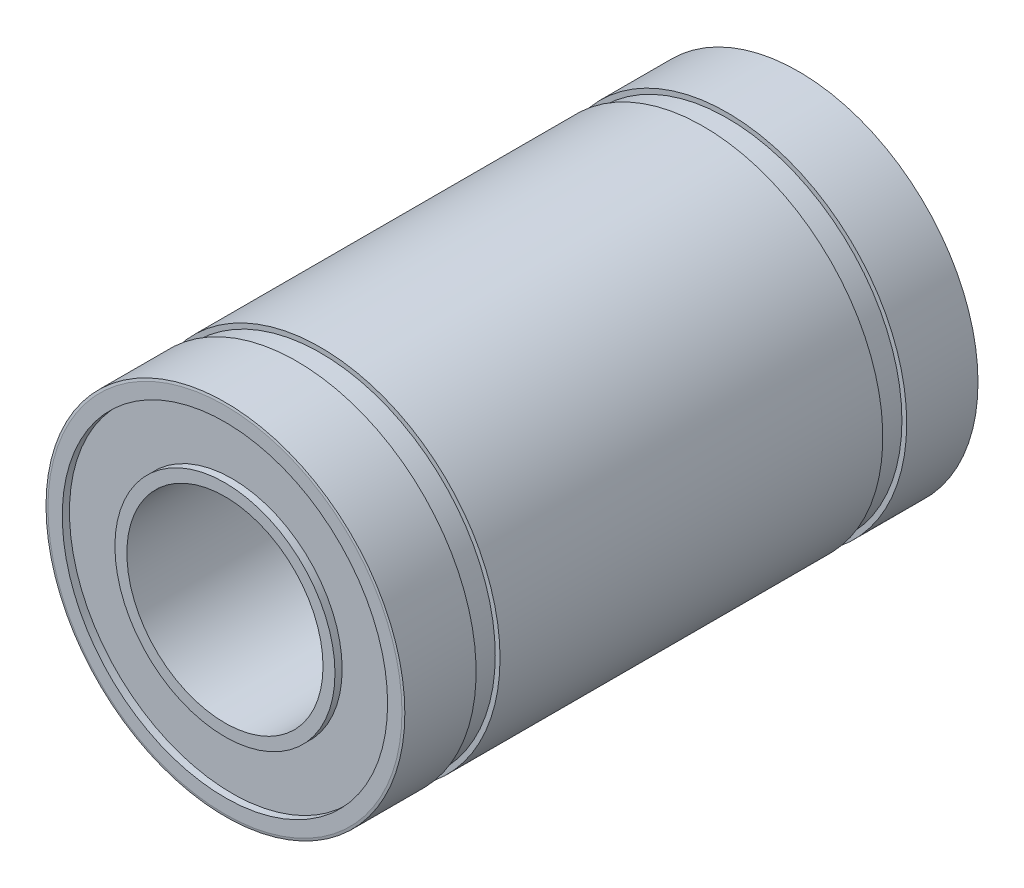
ISO-10303-21;
HEADER;
FILE_DESCRIPTION(('STEP AP214'),'2;1');
FILE_NAME('part.step','',(''),(''),'','','');
FILE_SCHEMA(('AUTOMOTIVE_DESIGN { 1 0 10303 214 1 1 1 1 }'));
ENDSEC;
DATA;
#1=APPLICATION_CONTEXT('core data for automotive mechanical design processes');
#2=APPLICATION_PROTOCOL_DEFINITION('international standard','automotive_design',2000,#1);
#3=PRODUCT_CONTEXT('',#1,'mechanical');
#4=PRODUCT('Part','Part','',(#3));
#5=PRODUCT_RELATED_PRODUCT_CATEGORY('part','',(#4));
#6=PRODUCT_DEFINITION_FORMATION('','',#4);
#7=PRODUCT_DEFINITION_CONTEXT('part definition',#1,'design');
#8=PRODUCT_DEFINITION('design','',#6,#7);
#9=PRODUCT_DEFINITION_SHAPE('','',#8);
#10=(LENGTH_UNIT() NAMED_UNIT(*) SI_UNIT(.MILLI.,.METRE.));
#11=(NAMED_UNIT(*) PLANE_ANGLE_UNIT() SI_UNIT($,.RADIAN.));
#12=(NAMED_UNIT(*) SI_UNIT($,.STERADIAN.) SOLID_ANGLE_UNIT());
#13=UNCERTAINTY_MEASURE_WITH_UNIT(LENGTH_MEASURE(1.E-05),#10,'distance_accuracy_value','');
#14=(GEOMETRIC_REPRESENTATION_CONTEXT(3) GLOBAL_UNCERTAINTY_ASSIGNED_CONTEXT((#13)) GLOBAL_UNIT_ASSIGNED_CONTEXT((#10,
#11,#12)) REPRESENTATION_CONTEXT('',''));
#15=CARTESIAN_POINT('',(0.,0.,0.));
#16=DIRECTION('',(0.,0.,1.));
#17=DIRECTION('',(1.,0.,0.));
#18=AXIS2_PLACEMENT_3D('',#15,#16,#17);
#19=CARTESIAN_POINT('',(0.,0.,24.));
#20=DIRECTION('',(0.,0.,-1.));
#21=DIRECTION('',(-1.,0.,0.));
#22=AXIS2_PLACEMENT_3D('',#19,#20,#21);
#23=CYLINDRICAL_SURFACE('',#22,7.5);
#24=CARTESIAN_POINT('',(0.,0.,23.98));
#25=DIRECTION('',(0.,0.,1.));
#26=DIRECTION('',(1.,0.,0.));
#27=AXIS2_PLACEMENT_3D('',#24,#25,#26);
#28=CIRCLE('',#27,7.5);
#29=CARTESIAN_POINT('',(7.5,0.,23.98));
#30=VERTEX_POINT('',#29);
#31=EDGE_CURVE('E90',#30,#30,#28,.T.);
#32=ORIENTED_EDGE('',*,*,#31,.F.);
#33=EDGE_LOOP('',(#32));
#34=FACE_BOUND('',#33,.T.);
#35=CARTESIAN_POINT('',(0.,0.,21.));
#36=DIRECTION('',(0.,0.,-1.));
#37=DIRECTION('',(-1.,0.,0.));
#38=AXIS2_PLACEMENT_3D('',#35,#36,#37);
#39=CIRCLE('',#38,7.5);
#40=CARTESIAN_POINT('',(-7.5,0.,21.));
#41=VERTEX_POINT('',#40);
#42=EDGE_CURVE('E36',#41,#41,#39,.T.);
#43=ORIENTED_EDGE('',*,*,#42,.F.);
#44=EDGE_LOOP('',(#43));
#45=FACE_BOUND('',#44,.T.);
#46=ADVANCED_FACE('F32',(#34,#45),#23,.T.);
#47=CARTESIAN_POINT('',(0.,0.,4.));
#48=DIRECTION('',(0.,0.,-1.));
#49=DIRECTION('',(-1.,0.,0.));
#50=AXIS2_PLACEMENT_3D('',#47,#48,#49);
#51=CIRCLE('',#50,7.5);
#52=CARTESIAN_POINT('',(-7.5,0.,4.));
#53=VERTEX_POINT('',#52);
#54=EDGE_CURVE('E50',#53,#53,#51,.T.);
#55=ORIENTED_EDGE('',*,*,#54,.F.);
#56=EDGE_LOOP('',(#55));
#57=FACE_BOUND('',#56,.T.);
#58=CARTESIAN_POINT('',(0.,0.,20.));
#59=DIRECTION('',(0.,0.,1.));
#60=DIRECTION('',(1.,0.,0.));
#61=AXIS2_PLACEMENT_3D('',#58,#59,#60);
#62=CIRCLE('',#61,7.5);
#63=CARTESIAN_POINT('',(7.5,0.,20.));
#64=VERTEX_POINT('',#63);
#65=EDGE_CURVE('E57',#64,#64,#62,.T.);
#66=ORIENTED_EDGE('',*,*,#65,.F.);
#67=EDGE_LOOP('',(#66));
#68=FACE_BOUND('',#67,.T.);
#69=ADVANCED_FACE('F128',(#57,#68),#23,.T.);
#70=CARTESIAN_POINT('',(0.,0.,0.0199999999999992));
#71=DIRECTION('',(0.,0.,1.));
#72=DIRECTION('',(1.,0.,0.));
#73=AXIS2_PLACEMENT_3D('',#70,#71,#72);
#74=CIRCLE('',#73,7.5);
#75=CARTESIAN_POINT('',(7.5,0.,0.0199999999999992));
#76=VERTEX_POINT('',#75);
#77=EDGE_CURVE('E45',#76,#76,#74,.T.);
#78=ORIENTED_EDGE('',*,*,#77,.T.);
#79=EDGE_LOOP('',(#78));
#80=FACE_BOUND('',#79,.T.);
#81=CARTESIAN_POINT('',(0.,0.,3.));
#82=DIRECTION('',(0.,0.,1.));
#83=DIRECTION('',(1.,0.,0.));
#84=AXIS2_PLACEMENT_3D('',#81,#82,#83);
#85=CIRCLE('',#84,7.5);
#86=CARTESIAN_POINT('',(7.5,0.,3.));
#87=VERTEX_POINT('',#86);
#88=EDGE_CURVE('E53',#87,#87,#85,.T.);
#89=ORIENTED_EDGE('',*,*,#88,.F.);
#90=EDGE_LOOP('',(#89));
#91=FACE_BOUND('',#90,.T.);
#92=ADVANCED_FACE('F34',(#80,#91),#23,.T.);
#93=CARTESIAN_POINT('',(0.,0.,24.));
#94=DIRECTION('',(0.,0.,1.));
#95=DIRECTION('',(1.,0.,0.));
#96=AXIS2_PLACEMENT_3D('',#93,#94,#95);
#97=PLANE('',#96);
#98=CARTESIAN_POINT('',(0.,0.,24.));
#99=DIRECTION('',(0.,0.,1.));
#100=DIRECTION('',(1.,0.,0.));
#101=AXIS2_PLACEMENT_3D('',#98,#99,#100);
#102=CIRCLE('',#101,4.1);
#103=CARTESIAN_POINT('',(4.1,0.,24.));
#104=VERTEX_POINT('',#103);
#105=EDGE_CURVE('E10',#104,#104,#102,.T.);
#106=ORIENTED_EDGE('',*,*,#105,.F.);
#107=EDGE_LOOP('',(#106));
#108=FACE_BOUND('',#107,.T.);
#109=CARTESIAN_POINT('',(0.,0.,24.));
#110=DIRECTION('',(0.,0.,1.));
#111=DIRECTION('',(1.,0.,0.));
#112=AXIS2_PLACEMENT_3D('',#109,#110,#111);
#113=CIRCLE('',#112,4.6);
#114=CARTESIAN_POINT('',(4.6,0.,24.));
#115=VERTEX_POINT('',#114);
#116=EDGE_CURVE('E56',#115,#115,#113,.T.);
#117=ORIENTED_EDGE('',*,*,#116,.T.);
#118=EDGE_LOOP('',(#117));
#119=FACE_BOUND('',#118,.T.);
#120=ADVANCED_FACE('F137',(#108,#119),#97,.T.);
#121=CARTESIAN_POINT('',(0.,0.,0.));
#122=DIRECTION('',(0.,0.,1.));
#123=DIRECTION('',(1.,0.,0.));
#124=AXIS2_PLACEMENT_3D('',#121,#122,#123);
#125=PLANE('',#124);
#126=CARTESIAN_POINT('',(0.,0.,0.));
#127=DIRECTION('',(0.,0.,1.));
#128=DIRECTION('',(1.,0.,0.));
#129=AXIS2_PLACEMENT_3D('',#126,#127,#128);
#130=CIRCLE('',#129,4.1);
#131=CARTESIAN_POINT('',(4.1,0.,0.));
#132=VERTEX_POINT('',#131);
#133=EDGE_CURVE('E40',#132,#132,#130,.T.);
#134=ORIENTED_EDGE('',*,*,#133,.T.);
#135=EDGE_LOOP('',(#134));
#136=FACE_BOUND('',#135,.T.);
#137=CARTESIAN_POINT('',(0.,0.,0.));
#138=DIRECTION('',(0.,0.,1.));
#139=DIRECTION('',(1.,0.,0.));
#140=AXIS2_PLACEMENT_3D('',#137,#138,#139);
#141=CIRCLE('',#140,4.6);
#142=CARTESIAN_POINT('',(4.6,0.,0.));
#143=VERTEX_POINT('',#142);
#144=EDGE_CURVE('E93',#143,#143,#141,.T.);
#145=ORIENTED_EDGE('',*,*,#144,.F.);
#146=EDGE_LOOP('',(#145));
#147=FACE_BOUND('',#146,.T.);
#148=ADVANCED_FACE('F125',(#136,#147),#125,.F.);
#149=CARTESIAN_POINT('',(0.,0.,24.));
#150=DIRECTION('',(0.,0.,-1.));
#151=DIRECTION('',(-1.,0.,0.));
#152=AXIS2_PLACEMENT_3D('',#149,#150,#151);
#153=CYLINDRICAL_SURFACE('',#152,4.1);
#154=ORIENTED_EDGE('',*,*,#105,.T.);
#155=EDGE_LOOP('',(#154));
#156=FACE_BOUND('',#155,.T.);
#157=ORIENTED_EDGE('',*,*,#133,.F.);
#158=EDGE_LOOP('',(#157));
#159=FACE_BOUND('',#158,.T.);
#160=ADVANCED_FACE('F116',(#156,#159),#153,.F.);
#161=CARTESIAN_POINT('',(0.,0.,0.0199999999999992));
#162=DIRECTION('',(0.,0.,1.));
#163=DIRECTION('',(1.,0.,0.));
#164=AXIS2_PLACEMENT_3D('',#161,#162,#163);
#165=CONICAL_SURFACE('',#164,7.5,1.37340076694502);
#166=CARTESIAN_POINT('',(0.,0.,0.));
#167=DIRECTION('',(0.,0.,1.));
#168=DIRECTION('',(1.,0.,0.));
#169=AXIS2_PLACEMENT_3D('',#166,#167,#168);
#170=CIRCLE('',#169,7.4);
#171=CARTESIAN_POINT('',(7.4,0.,0.));
#172=VERTEX_POINT('',#171);
#173=EDGE_CURVE('E104',#172,#172,#170,.T.);
#174=ORIENTED_EDGE('',*,*,#173,.T.);
#175=EDGE_LOOP('',(#174));
#176=FACE_BOUND('',#175,.T.);
#177=ORIENTED_EDGE('',*,*,#77,.F.);
#178=EDGE_LOOP('',(#177));
#179=FACE_BOUND('',#178,.T.);
#180=ADVANCED_FACE('F113',(#176,#179),#165,.T.);
#181=CARTESIAN_POINT('',(0.,0.,24.));
#182=DIRECTION('',(0.,0.,1.));
#183=DIRECTION('',(1.,0.,0.));
#184=AXIS2_PLACEMENT_3D('',#181,#182,#183);
#185=CYLINDRICAL_SURFACE('',#184,6.8);
#186=CARTESIAN_POINT('',(0.,0.,0.300000000000002));
#187=DIRECTION('',(0.,0.,1.));
#188=DIRECTION('',(1.,0.,0.));
#189=AXIS2_PLACEMENT_3D('',#186,#187,#188);
#190=CIRCLE('',#189,6.8);
#191=CARTESIAN_POINT('',(6.8,0.,0.300000000000002));
#192=VERTEX_POINT('',#191);
#193=EDGE_CURVE('E99',#192,#192,#190,.T.);
#194=ORIENTED_EDGE('',*,*,#193,.T.);
#195=EDGE_LOOP('',(#194));
#196=FACE_BOUND('',#195,.T.);
#197=CARTESIAN_POINT('',(0.,0.,0.));
#198=DIRECTION('',(0.,0.,1.));
#199=DIRECTION('',(1.,0.,0.));
#200=AXIS2_PLACEMENT_3D('',#197,#198,#199);
#201=CIRCLE('',#200,6.8);
#202=CARTESIAN_POINT('',(6.8,0.,0.));
#203=VERTEX_POINT('',#202);
#204=EDGE_CURVE('E102',#203,#203,#201,.T.);
#205=ORIENTED_EDGE('',*,*,#204,.F.);
#206=EDGE_LOOP('',(#205));
#207=FACE_BOUND('',#206,.T.);
#208=ADVANCED_FACE('F115',(#196,#207),#185,.F.);
#209=CARTESIAN_POINT('',(-6.8,0.,0.3));
#210=DIRECTION('',(0.,0.,-1.));
#211=DIRECTION('',(-1.,0.,0.));
#212=AXIS2_PLACEMENT_3D('',#209,#210,#211);
#213=PLANE('',#212);
#214=CARTESIAN_POINT('',(0.,0.,0.300000000000002));
#215=DIRECTION('',(0.,0.,1.));
#216=DIRECTION('',(1.,0.,0.));
#217=AXIS2_PLACEMENT_3D('',#214,#215,#216);
#218=CIRCLE('',#217,4.6);
#219=CARTESIAN_POINT('',(4.6,0.,0.300000000000002));
#220=VERTEX_POINT('',#219);
#221=EDGE_CURVE('E96',#220,#220,#218,.T.);
#222=ORIENTED_EDGE('',*,*,#221,.T.);
#223=EDGE_LOOP('',(#222));
#224=FACE_BOUND('',#223,.T.);
#225=ORIENTED_EDGE('',*,*,#193,.F.);
#226=EDGE_LOOP('',(#225));
#227=FACE_BOUND('',#226,.T.);
#228=ADVANCED_FACE('F122',(#224,#227),#213,.T.);
#229=CARTESIAN_POINT('',(0.,0.,24.));
#230=DIRECTION('',(0.,0.,1.));
#231=DIRECTION('',(1.,0.,0.));
#232=AXIS2_PLACEMENT_3D('',#229,#230,#231);
#233=CYLINDRICAL_SURFACE('',#232,4.6);
#234=ORIENTED_EDGE('',*,*,#144,.T.);
#235=EDGE_LOOP('',(#234));
#236=FACE_BOUND('',#235,.T.);
#237=ORIENTED_EDGE('',*,*,#221,.F.);
#238=EDGE_LOOP('',(#237));
#239=FACE_BOUND('',#238,.T.);
#240=ADVANCED_FACE('F185',(#236,#239),#233,.T.);
#241=ORIENTED_EDGE('',*,*,#204,.T.);
#242=EDGE_LOOP('',(#241));
#243=FACE_BOUND('',#242,.T.);
#244=ORIENTED_EDGE('',*,*,#173,.F.);
#245=EDGE_LOOP('',(#244));
#246=FACE_BOUND('',#245,.T.);
#247=ADVANCED_FACE('F148',(#243,#246),#125,.F.);
#248=CARTESIAN_POINT('',(0.,0.,24.));
#249=DIRECTION('',(0.,0.,1.));
#250=DIRECTION('',(1.,0.,0.));
#251=AXIS2_PLACEMENT_3D('',#248,#249,#250);
#252=CYLINDRICAL_SURFACE('',#251,6.8);
#253=CARTESIAN_POINT('',(0.,0.,24.));
#254=DIRECTION('',(0.,0.,1.));
#255=DIRECTION('',(1.,0.,0.));
#256=AXIS2_PLACEMENT_3D('',#253,#254,#255);
#257=CIRCLE('',#256,6.8);
#258=CARTESIAN_POINT('',(6.8,0.,24.));
#259=VERTEX_POINT('',#258);
#260=EDGE_CURVE('E84',#259,#259,#257,.T.);
#261=ORIENTED_EDGE('',*,*,#260,.T.);
#262=EDGE_LOOP('',(#261));
#263=FACE_BOUND('',#262,.T.);
#264=CARTESIAN_POINT('',(0.,0.,23.7));
#265=DIRECTION('',(0.,0.,1.));
#266=DIRECTION('',(1.,0.,0.));
#267=AXIS2_PLACEMENT_3D('',#264,#265,#266);
#268=CIRCLE('',#267,6.8);
#269=CARTESIAN_POINT('',(6.8,0.,23.7));
#270=VERTEX_POINT('',#269);
#271=EDGE_CURVE('E81',#270,#270,#268,.T.);
#272=ORIENTED_EDGE('',*,*,#271,.F.);
#273=EDGE_LOOP('',(#272));
#274=FACE_BOUND('',#273,.T.);
#275=ADVANCED_FACE('F169',(#263,#274),#252,.F.);
#276=CARTESIAN_POINT('',(-6.8,0.,23.7));
#277=DIRECTION('',(0.,0.,1.));
#278=DIRECTION('',(1.,0.,0.));
#279=AXIS2_PLACEMENT_3D('',#276,#277,#278);
#280=PLANE('',#279);
#281=ORIENTED_EDGE('',*,*,#271,.T.);
#282=EDGE_LOOP('',(#281));
#283=FACE_BOUND('',#282,.T.);
#284=CARTESIAN_POINT('',(0.,0.,23.7));
#285=DIRECTION('',(0.,0.,1.));
#286=DIRECTION('',(1.,0.,0.));
#287=AXIS2_PLACEMENT_3D('',#284,#285,#286);
#288=CIRCLE('',#287,4.6);
#289=CARTESIAN_POINT('',(4.6,0.,23.7));
#290=VERTEX_POINT('',#289);
#291=EDGE_CURVE('E78',#290,#290,#288,.T.);
#292=ORIENTED_EDGE('',*,*,#291,.F.);
#293=EDGE_LOOP('',(#292));
#294=FACE_BOUND('',#293,.T.);
#295=ADVANCED_FACE('F161',(#283,#294),#280,.T.);
#296=CARTESIAN_POINT('',(0.,0.,24.));
#297=DIRECTION('',(0.,0.,1.));
#298=DIRECTION('',(1.,0.,0.));
#299=AXIS2_PLACEMENT_3D('',#296,#297,#298);
#300=CYLINDRICAL_SURFACE('',#299,4.6);
#301=ORIENTED_EDGE('',*,*,#291,.T.);
#302=EDGE_LOOP('',(#301));
#303=FACE_BOUND('',#302,.T.);
#304=ORIENTED_EDGE('',*,*,#116,.F.);
#305=EDGE_LOOP('',(#304));
#306=FACE_BOUND('',#305,.T.);
#307=ADVANCED_FACE('F152',(#303,#306),#300,.T.);
#308=ORIENTED_EDGE('',*,*,#260,.F.);
#309=EDGE_LOOP('',(#308));
#310=FACE_BOUND('',#309,.T.);
#311=CARTESIAN_POINT('',(0.,0.,24.));
#312=DIRECTION('',(0.,0.,1.));
#313=DIRECTION('',(1.,0.,0.));
#314=AXIS2_PLACEMENT_3D('',#311,#312,#313);
#315=CIRCLE('',#314,7.4);
#316=CARTESIAN_POINT('',(7.4,0.,24.));
#317=VERTEX_POINT('',#316);
#318=EDGE_CURVE('E87',#317,#317,#315,.T.);
#319=ORIENTED_EDGE('',*,*,#318,.T.);
#320=EDGE_LOOP('',(#319));
#321=FACE_BOUND('',#320,.T.);
#322=ADVANCED_FACE('F143',(#310,#321),#97,.T.);
#323=CARTESIAN_POINT('',(0.,0.,24.));
#324=DIRECTION('',(0.,0.,-1.));
#325=DIRECTION('',(-1.,0.,0.));
#326=AXIS2_PLACEMENT_3D('',#323,#324,#325);
#327=CONICAL_SURFACE('',#326,7.4,1.37340076694502);
#328=ORIENTED_EDGE('',*,*,#31,.T.);
#329=EDGE_LOOP('',(#328));
#330=FACE_BOUND('',#329,.T.);
#331=ORIENTED_EDGE('',*,*,#318,.F.);
#332=EDGE_LOOP('',(#331));
#333=FACE_BOUND('',#332,.T.);
#334=ADVANCED_FACE('F151',(#330,#333),#327,.T.);
#335=CARTESIAN_POINT('',(-7.7,0.,3.));
#336=DIRECTION('',(0.,0.,1.));
#337=DIRECTION('',(1.,0.,0.));
#338=AXIS2_PLACEMENT_3D('',#335,#336,#337);
#339=PLANE('',#338);
#340=CARTESIAN_POINT('',(0.,0.,3.));
#341=DIRECTION('',(0.,0.,1.));
#342=DIRECTION('',(1.,0.,0.));
#343=AXIS2_PLACEMENT_3D('',#340,#341,#342);
#344=CIRCLE('',#343,7.3);
#345=CARTESIAN_POINT('',(7.3,0.,3.));
#346=VERTEX_POINT('',#345);
#347=EDGE_CURVE('E54',#346,#346,#344,.T.);
#348=ORIENTED_EDGE('',*,*,#347,.F.);
#349=EDGE_LOOP('',(#348));
#350=FACE_BOUND('',#349,.T.);
#351=ORIENTED_EDGE('',*,*,#88,.T.);
#352=EDGE_LOOP('',(#351));
#353=FACE_BOUND('',#352,.T.);
#354=ADVANCED_FACE('F158',(#350,#353),#339,.T.);
#355=CARTESIAN_POINT('',(-7.7,0.,4.));
#356=DIRECTION('',(0.,0.,-1.));
#357=DIRECTION('',(-1.,0.,0.));
#358=AXIS2_PLACEMENT_3D('',#355,#356,#357);
#359=PLANE('',#358);
#360=CARTESIAN_POINT('',(0.,0.,4.));
#361=DIRECTION('',(0.,0.,1.));
#362=DIRECTION('',(1.,0.,0.));
#363=AXIS2_PLACEMENT_3D('',#360,#361,#362);
#364=CIRCLE('',#363,7.3);
#365=CARTESIAN_POINT('',(7.3,0.,4.));
#366=VERTEX_POINT('',#365);
#367=EDGE_CURVE('E63',#366,#366,#364,.T.);
#368=ORIENTED_EDGE('',*,*,#367,.T.);
#369=EDGE_LOOP('',(#368));
#370=FACE_BOUND('',#369,.T.);
#371=ORIENTED_EDGE('',*,*,#54,.T.);
#372=EDGE_LOOP('',(#371));
#373=FACE_BOUND('',#372,.T.);
#374=ADVANCED_FACE('F247',(#370,#373),#359,.T.);
#375=CARTESIAN_POINT('',(0.,0.,24.));
#376=DIRECTION('',(0.,0.,1.));
#377=DIRECTION('',(1.,0.,0.));
#378=AXIS2_PLACEMENT_3D('',#375,#376,#377);
#379=CYLINDRICAL_SURFACE('',#378,7.3);
#380=ORIENTED_EDGE('',*,*,#347,.T.);
#381=EDGE_LOOP('',(#380));
#382=FACE_BOUND('',#381,.T.);
#383=ORIENTED_EDGE('',*,*,#367,.F.);
#384=EDGE_LOOP('',(#383));
#385=FACE_BOUND('',#384,.T.);
#386=ADVANCED_FACE('F257',(#382,#385),#379,.T.);
#387=CARTESIAN_POINT('',(-7.7,0.,21.));
#388=DIRECTION('',(0.,0.,-1.));
#389=DIRECTION('',(-1.,0.,0.));
#390=AXIS2_PLACEMENT_3D('',#387,#388,#389);
#391=PLANE('',#390);
#392=CARTESIAN_POINT('',(0.,0.,21.));
#393=DIRECTION('',(0.,0.,1.));
#394=DIRECTION('',(1.,0.,0.));
#395=AXIS2_PLACEMENT_3D('',#392,#393,#394);
#396=CIRCLE('',#395,7.3);
#397=CARTESIAN_POINT('',(7.3,0.,21.));
#398=VERTEX_POINT('',#397);
#399=EDGE_CURVE('E59',#398,#398,#396,.T.);
#400=ORIENTED_EDGE('',*,*,#399,.T.);
#401=EDGE_LOOP('',(#400));
#402=FACE_BOUND('',#401,.T.);
#403=ORIENTED_EDGE('',*,*,#42,.T.);
#404=EDGE_LOOP('',(#403));
#405=FACE_BOUND('',#404,.T.);
#406=ADVANCED_FACE('F268',(#402,#405),#391,.T.);
#407=CARTESIAN_POINT('',(-7.7,0.,20.));
#408=DIRECTION('',(0.,0.,1.));
#409=DIRECTION('',(1.,0.,0.));
#410=AXIS2_PLACEMENT_3D('',#407,#408,#409);
#411=PLANE('',#410);
#412=CARTESIAN_POINT('',(0.,0.,20.));
#413=DIRECTION('',(0.,0.,1.));
#414=DIRECTION('',(1.,0.,0.));
#415=AXIS2_PLACEMENT_3D('',#412,#413,#414);
#416=CIRCLE('',#415,7.3);
#417=CARTESIAN_POINT('',(7.3,0.,20.));
#418=VERTEX_POINT('',#417);
#419=EDGE_CURVE('E65',#418,#418,#416,.T.);
#420=ORIENTED_EDGE('',*,*,#419,.F.);
#421=EDGE_LOOP('',(#420));
#422=FACE_BOUND('',#421,.T.);
#423=ORIENTED_EDGE('',*,*,#65,.T.);
#424=EDGE_LOOP('',(#423));
#425=FACE_BOUND('',#424,.T.);
#426=ADVANCED_FACE('F278',(#422,#425),#411,.T.);
#427=CARTESIAN_POINT('',(0.,0.,24.));
#428=DIRECTION('',(0.,0.,1.));
#429=DIRECTION('',(1.,0.,0.));
#430=AXIS2_PLACEMENT_3D('',#427,#428,#429);
#431=CYLINDRICAL_SURFACE('',#430,7.3);
#432=ORIENTED_EDGE('',*,*,#419,.T.);
#433=EDGE_LOOP('',(#432));
#434=FACE_BOUND('',#433,.T.);
#435=ORIENTED_EDGE('',*,*,#399,.F.);
#436=EDGE_LOOP('',(#435));
#437=FACE_BOUND('',#436,.T.);
#438=ADVANCED_FACE('F287',(#434,#437),#431,.T.);
#439=CLOSED_SHELL('',(#46,#69,#92,#120,#148,#160,#180,#208,#228,#240,#247,#275,#295,#307,#322,
#334,#354,#374,#386,#406,#426,#438));
#440=MANIFOLD_SOLID_BREP('B2',#439);
#441=ADVANCED_BREP_SHAPE_REPRESENTATION('',(#18,#440),#14);
#442=SHAPE_DEFINITION_REPRESENTATION(#9,#441);
ENDSEC;
END-ISO-10303-21;
